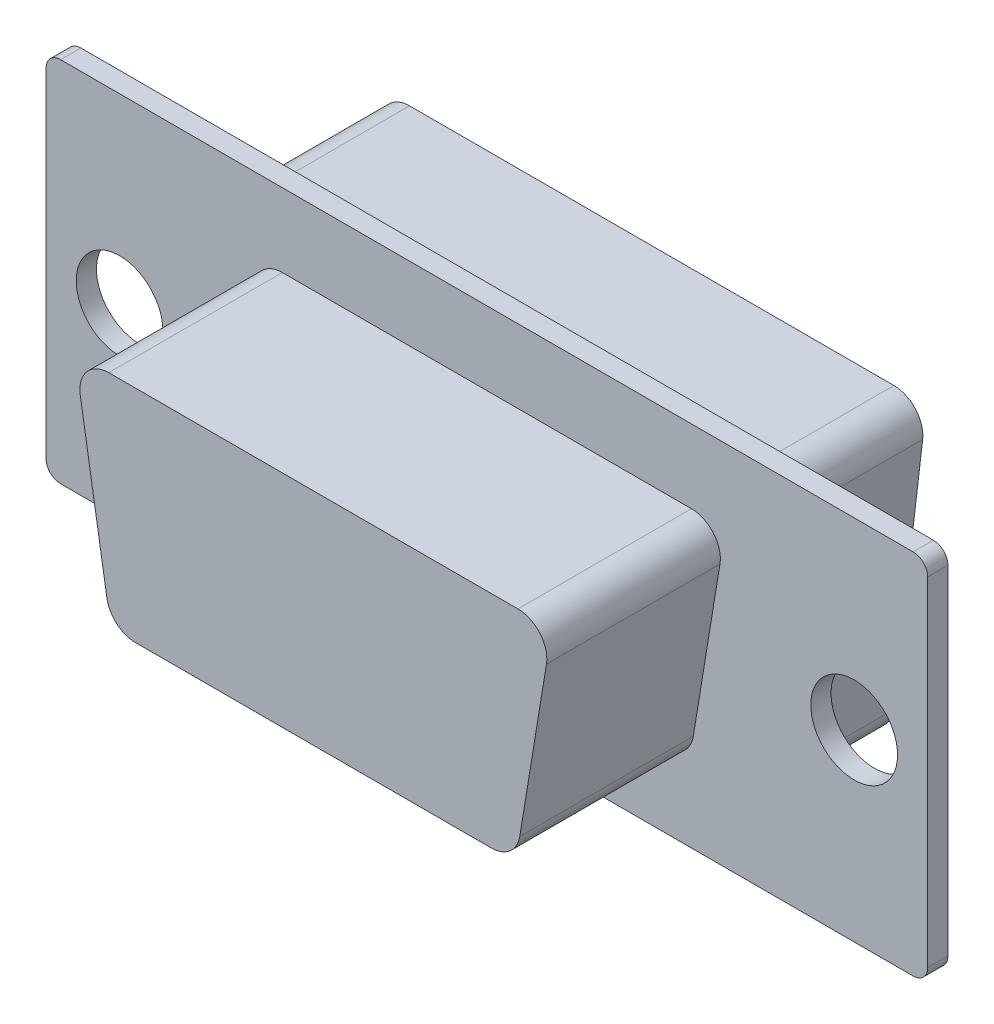
ISO-10303-21;
HEADER;
FILE_DESCRIPTION(('STEP AP214'),'2;1');
FILE_NAME('part.step','',(''),(''),'','','');
FILE_SCHEMA(('AUTOMOTIVE_DESIGN { 1 0 10303 214 1 1 1 1 }'));
ENDSEC;
DATA;
#1=APPLICATION_CONTEXT('core data for automotive mechanical design processes');
#2=APPLICATION_PROTOCOL_DEFINITION('international standard','automotive_design',2000,#1);
#3=PRODUCT_CONTEXT('',#1,'mechanical');
#4=PRODUCT('Part','Part','',(#3));
#5=PRODUCT_RELATED_PRODUCT_CATEGORY('part','',(#4));
#6=PRODUCT_DEFINITION_FORMATION('','',#4);
#7=PRODUCT_DEFINITION_CONTEXT('part definition',#1,'design');
#8=PRODUCT_DEFINITION('design','',#6,#7);
#9=PRODUCT_DEFINITION_SHAPE('','',#8);
#10=(LENGTH_UNIT() NAMED_UNIT(*) SI_UNIT(.MILLI.,.METRE.));
#11=(NAMED_UNIT(*) PLANE_ANGLE_UNIT() SI_UNIT($,.RADIAN.));
#12=(NAMED_UNIT(*) SI_UNIT($,.STERADIAN.) SOLID_ANGLE_UNIT());
#13=UNCERTAINTY_MEASURE_WITH_UNIT(LENGTH_MEASURE(1.E-05),#10,'distance_accuracy_value','');
#14=(GEOMETRIC_REPRESENTATION_CONTEXT(3) GLOBAL_UNCERTAINTY_ASSIGNED_CONTEXT((#13)) GLOBAL_UNIT_ASSIGNED_CONTEXT((#10,
#11,#12)) REPRESENTATION_CONTEXT('',''));
#15=CARTESIAN_POINT('',(0.,0.,0.));
#16=DIRECTION('',(0.,0.,1.));
#17=DIRECTION('',(1.,0.,0.));
#18=AXIS2_PLACEMENT_3D('',#15,#16,#17);
#19=CARTESIAN_POINT('',(0.,0.,0.));
#20=DIRECTION('',(0.,0.,1.));
#21=DIRECTION('',(1.,0.,0.));
#22=AXIS2_PLACEMENT_3D('',#19,#20,#21);
#23=PLANE('',#22);
#24=DIRECTION('',(1.,0.,0.));
#25=VECTOR('',#24,1.);
#26=CARTESIAN_POINT('',(-15.24,-6.35,0.));
#27=LINE('',#26,#25);
#28=CARTESIAN_POINT('',(-14.74,-6.35,0.));
#29=VERTEX_POINT('',#28);
#30=CARTESIAN_POINT('',(14.74,-6.35,0.));
#31=VERTEX_POINT('',#30);
#32=EDGE_CURVE('E210',#29,#31,#27,.T.);
#33=ORIENTED_EDGE('',*,*,#32,.F.);
#34=CARTESIAN_POINT('',(-14.74,-5.85,0.));
#35=DIRECTION('',(0.,0.,1.));
#36=DIRECTION('',(1.,0.,0.));
#37=AXIS2_PLACEMENT_3D('',#34,#35,#36);
#38=CIRCLE('',#37,0.5);
#39=CARTESIAN_POINT('',(-15.24,-5.85,0.));
#40=VERTEX_POINT('',#39);
#41=EDGE_CURVE('E193',#29,#40,#38,.F.);
#42=ORIENTED_EDGE('',*,*,#41,.T.);
#43=DIRECTION('',(0.,-1.,0.));
#44=VECTOR('',#43,1.);
#45=CARTESIAN_POINT('',(-15.24,6.35,0.));
#46=LINE('',#45,#44);
#47=CARTESIAN_POINT('',(-15.24,5.85,0.));
#48=VERTEX_POINT('',#47);
#49=EDGE_CURVE('E220',#48,#40,#46,.T.);
#50=ORIENTED_EDGE('',*,*,#49,.F.);
#51=CARTESIAN_POINT('',(-14.74,5.85,0.));
#52=DIRECTION('',(0.,0.,1.));
#53=DIRECTION('',(1.,0.,0.));
#54=AXIS2_PLACEMENT_3D('',#51,#52,#53);
#55=CIRCLE('',#54,0.5);
#56=CARTESIAN_POINT('',(-14.74,6.35,0.));
#57=VERTEX_POINT('',#56);
#58=EDGE_CURVE('E214',#48,#57,#55,.F.);
#59=ORIENTED_EDGE('',*,*,#58,.T.);
#60=DIRECTION('',(-1.,0.,0.));
#61=VECTOR('',#60,1.);
#62=CARTESIAN_POINT('',(-15.24,6.35,0.));
#63=LINE('',#62,#61);
#64=CARTESIAN_POINT('',(14.74,6.35,0.));
#65=VERTEX_POINT('',#64);
#66=EDGE_CURVE('E223',#65,#57,#63,.T.);
#67=ORIENTED_EDGE('',*,*,#66,.F.);
#68=CARTESIAN_POINT('',(14.74,5.85,0.));
#69=DIRECTION('',(0.,0.,1.));
#70=DIRECTION('',(1.,0.,0.));
#71=AXIS2_PLACEMENT_3D('',#68,#69,#70);
#72=CIRCLE('',#71,0.5);
#73=CARTESIAN_POINT('',(15.24,5.85,0.));
#74=VERTEX_POINT('',#73);
#75=EDGE_CURVE('E235',#65,#74,#72,.F.);
#76=ORIENTED_EDGE('',*,*,#75,.T.);
#77=DIRECTION('',(0.,1.,0.));
#78=VECTOR('',#77,1.);
#79=CARTESIAN_POINT('',(15.24,6.35,0.));
#80=LINE('',#79,#78);
#81=CARTESIAN_POINT('',(15.24,-5.85,0.));
#82=VERTEX_POINT('',#81);
#83=EDGE_CURVE('E219',#82,#74,#80,.T.);
#84=ORIENTED_EDGE('',*,*,#83,.F.);
#85=CARTESIAN_POINT('',(14.74,-5.85,0.));
#86=DIRECTION('',(0.,0.,1.));
#87=DIRECTION('',(1.,0.,0.));
#88=AXIS2_PLACEMENT_3D('',#85,#86,#87);
#89=CIRCLE('',#88,0.5);
#90=EDGE_CURVE('E204',#82,#31,#89,.F.);
#91=ORIENTED_EDGE('',*,*,#90,.T.);
#92=EDGE_LOOP('',(#33,#42,#50,#59,#67,#76,#84,#91));
#93=FACE_BOUND('',#92,.T.);
#94=CARTESIAN_POINT('',(-12.7,0.,0.));
#95=DIRECTION('',(0.,0.,1.));
#96=DIRECTION('',(1.,0.,0.));
#97=AXIS2_PLACEMENT_3D('',#94,#95,#96);
#98=CIRCLE('',#97,1.5);
#99=CARTESIAN_POINT('',(-11.2,0.,0.));
#100=VERTEX_POINT('',#99);
#101=EDGE_CURVE('E225',#100,#100,#98,.T.);
#102=ORIENTED_EDGE('',*,*,#101,.T.);
#103=EDGE_LOOP('',(#102));
#104=FACE_BOUND('',#103,.T.);
#105=CARTESIAN_POINT('',(12.7,0.,0.));
#106=DIRECTION('',(0.,0.,1.));
#107=DIRECTION('',(1.,0.,0.));
#108=AXIS2_PLACEMENT_3D('',#105,#106,#107);
#109=CIRCLE('',#108,1.5);
#110=CARTESIAN_POINT('',(14.2,0.,0.));
#111=VERTEX_POINT('',#110);
#112=EDGE_CURVE('E389',#111,#111,#109,.T.);
#113=ORIENTED_EDGE('',*,*,#112,.T.);
#114=EDGE_LOOP('',(#113));
#115=FACE_BOUND('',#114,.T.);
#116=DIRECTION('',(-0.117113041376648,-0.993118590873976,0.));
#117=VECTOR('',#116,1.);
#118=CARTESIAN_POINT('',(8.25,-5.3,0.));
#119=LINE('',#118,#117);
#120=CARTESIAN_POINT('',(9.36826497153577,4.18288695862336,0.));
#121=VERTEX_POINT('',#120);
#122=CARTESIAN_POINT('',(8.35411402813954,-4.41711304137665,0.));
#123=VERTEX_POINT('',#122);
#124=EDGE_CURVE('E362',#121,#123,#119,.T.);
#125=ORIENTED_EDGE('',*,*,#124,.F.);
#126=CARTESIAN_POINT('',(8.3751463806618,4.3,0.));
#127=DIRECTION('',(0.,0.,1.));
#128=DIRECTION('',(1.,0.,0.));
#129=AXIS2_PLACEMENT_3D('',#126,#127,#128);
#130=CIRCLE('',#129,1.);
#131=CARTESIAN_POINT('',(8.3751463806618,5.3,0.));
#132=VERTEX_POINT('',#131);
#133=EDGE_CURVE('E11',#121,#132,#130,.T.);
#134=ORIENTED_EDGE('',*,*,#133,.T.);
#135=DIRECTION('',(1.,0.,0.));
#136=VECTOR('',#135,1.);
#137=CARTESIAN_POINT('',(9.5,5.3,0.));
#138=LINE('',#137,#136);
#139=CARTESIAN_POINT('',(-8.3751463806618,5.3,0.));
#140=VERTEX_POINT('',#139);
#141=EDGE_CURVE('E330',#140,#132,#138,.T.);
#142=ORIENTED_EDGE('',*,*,#141,.F.);
#143=CARTESIAN_POINT('',(-8.3751463806618,4.3,0.));
#144=DIRECTION('',(0.,0.,1.));
#145=DIRECTION('',(1.,0.,0.));
#146=AXIS2_PLACEMENT_3D('',#143,#144,#145);
#147=CIRCLE('',#146,1.);
#148=CARTESIAN_POINT('',(-9.36826497153577,4.18288695862335,0.));
#149=VERTEX_POINT('',#148);
#150=EDGE_CURVE('E324',#140,#149,#147,.T.);
#151=ORIENTED_EDGE('',*,*,#150,.T.);
#152=DIRECTION('',(-0.117113041376648,0.993118590873976,0.));
#153=VECTOR('',#152,1.);
#154=CARTESIAN_POINT('',(-9.5,5.3,0.));
#155=LINE('',#154,#153);
#156=CARTESIAN_POINT('',(-8.35411402813954,-4.41711304137665,0.));
#157=VERTEX_POINT('',#156);
#158=EDGE_CURVE('E328',#157,#149,#155,.T.);
#159=ORIENTED_EDGE('',*,*,#158,.F.);
#160=CARTESIAN_POINT('',(-7.36099543726557,-4.3,0.));
#161=DIRECTION('',(0.,0.,1.));
#162=DIRECTION('',(1.,0.,0.));
#163=AXIS2_PLACEMENT_3D('',#160,#161,#162);
#164=CIRCLE('',#163,1.);
#165=CARTESIAN_POINT('',(-7.36099543726557,-5.3,0.));
#166=VERTEX_POINT('',#165);
#167=EDGE_CURVE('E322',#157,#166,#164,.T.);
#168=ORIENTED_EDGE('',*,*,#167,.T.);
#169=DIRECTION('',(-1.,0.,0.));
#170=VECTOR('',#169,1.);
#171=CARTESIAN_POINT('',(-8.25,-5.3,0.));
#172=LINE('',#171,#170);
#173=CARTESIAN_POINT('',(7.36099543726557,-5.3,0.));
#174=VERTEX_POINT('',#173);
#175=EDGE_CURVE('E339',#174,#166,#172,.T.);
#176=ORIENTED_EDGE('',*,*,#175,.F.);
#177=CARTESIAN_POINT('',(7.36099543726557,-4.3,0.));
#178=DIRECTION('',(0.,0.,1.));
#179=DIRECTION('',(1.,0.,0.));
#180=AXIS2_PLACEMENT_3D('',#177,#178,#179);
#181=CIRCLE('',#180,1.);
#182=EDGE_CURVE('E41',#174,#123,#181,.T.);
#183=ORIENTED_EDGE('',*,*,#182,.T.);
#184=EDGE_LOOP('',(#125,#134,#142,#151,#159,#168,#176,#183));
#185=FACE_BOUND('',#184,.T.);
#186=ADVANCED_FACE('F33',(#93,#104,#115,#185),#23,.F.);
#187=CARTESIAN_POINT('',(0.,0.,0.7));
#188=DIRECTION('',(0.,0.,1.));
#189=DIRECTION('',(1.,0.,0.));
#190=AXIS2_PLACEMENT_3D('',#187,#188,#189);
#191=PLANE('',#190);
#192=CARTESIAN_POINT('',(12.7,0.,0.7));
#193=DIRECTION('',(0.,0.,1.));
#194=DIRECTION('',(1.,0.,0.));
#195=AXIS2_PLACEMENT_3D('',#192,#193,#194);
#196=CIRCLE('',#195,1.5);
#197=CARTESIAN_POINT('',(14.2,0.,0.7));
#198=VERTEX_POINT('',#197);
#199=EDGE_CURVE('E380',#198,#198,#196,.T.);
#200=ORIENTED_EDGE('',*,*,#199,.F.);
#201=EDGE_LOOP('',(#200));
#202=FACE_BOUND('',#201,.T.);
#203=CARTESIAN_POINT('',(-12.7,0.,0.7));
#204=DIRECTION('',(0.,0.,1.));
#205=DIRECTION('',(1.,0.,0.));
#206=AXIS2_PLACEMENT_3D('',#203,#204,#205);
#207=CIRCLE('',#206,1.5);
#208=CARTESIAN_POINT('',(-11.2,0.,0.7));
#209=VERTEX_POINT('',#208);
#210=EDGE_CURVE('E392',#209,#209,#207,.T.);
#211=ORIENTED_EDGE('',*,*,#210,.F.);
#212=EDGE_LOOP('',(#211));
#213=FACE_BOUND('',#212,.T.);
#214=DIRECTION('',(0.,-1.,0.));
#215=VECTOR('',#214,1.);
#216=CARTESIAN_POINT('',(-15.24,6.35,0.7));
#217=LINE('',#216,#215);
#218=CARTESIAN_POINT('',(-15.24,5.85,0.7));
#219=VERTEX_POINT('',#218);
#220=CARTESIAN_POINT('',(-15.24,-5.85,0.7));
#221=VERTEX_POINT('',#220);
#222=EDGE_CURVE('E231',#219,#221,#217,.T.);
#223=ORIENTED_EDGE('',*,*,#222,.T.);
#224=CARTESIAN_POINT('',(-14.74,-5.85,0.7));
#225=DIRECTION('',(0.,0.,1.));
#226=DIRECTION('',(1.,0.,0.));
#227=AXIS2_PLACEMENT_3D('',#224,#225,#226);
#228=CIRCLE('',#227,0.5);
#229=CARTESIAN_POINT('',(-14.74,-6.35,0.7));
#230=VERTEX_POINT('',#229);
#231=EDGE_CURVE('E247',#221,#230,#228,.T.);
#232=ORIENTED_EDGE('',*,*,#231,.T.);
#233=DIRECTION('',(1.,0.,0.));
#234=VECTOR('',#233,1.);
#235=CARTESIAN_POINT('',(-15.24,-6.35,0.7));
#236=LINE('',#235,#234);
#237=CARTESIAN_POINT('',(14.74,-6.35,0.7));
#238=VERTEX_POINT('',#237);
#239=EDGE_CURVE('E213',#230,#238,#236,.T.);
#240=ORIENTED_EDGE('',*,*,#239,.T.);
#241=CARTESIAN_POINT('',(14.74,-5.85,0.7));
#242=DIRECTION('',(0.,0.,1.));
#243=DIRECTION('',(1.,0.,0.));
#244=AXIS2_PLACEMENT_3D('',#241,#242,#243);
#245=CIRCLE('',#244,0.5);
#246=CARTESIAN_POINT('',(15.24,-5.85,0.7));
#247=VERTEX_POINT('',#246);
#248=EDGE_CURVE('E245',#238,#247,#245,.T.);
#249=ORIENTED_EDGE('',*,*,#248,.T.);
#250=DIRECTION('',(0.,1.,0.));
#251=VECTOR('',#250,1.);
#252=CARTESIAN_POINT('',(15.24,6.35,0.7));
#253=LINE('',#252,#251);
#254=CARTESIAN_POINT('',(15.24,5.85,0.7));
#255=VERTEX_POINT('',#254);
#256=EDGE_CURVE('E402',#247,#255,#253,.T.);
#257=ORIENTED_EDGE('',*,*,#256,.T.);
#258=CARTESIAN_POINT('',(14.74,5.85,0.7));
#259=DIRECTION('',(0.,0.,1.));
#260=DIRECTION('',(1.,0.,0.));
#261=AXIS2_PLACEMENT_3D('',#258,#259,#260);
#262=CIRCLE('',#261,0.5);
#263=CARTESIAN_POINT('',(14.74,6.35,0.7));
#264=VERTEX_POINT('',#263);
#265=EDGE_CURVE('E243',#255,#264,#262,.T.);
#266=ORIENTED_EDGE('',*,*,#265,.T.);
#267=DIRECTION('',(-1.,0.,0.));
#268=VECTOR('',#267,1.);
#269=CARTESIAN_POINT('',(-15.24,6.35,0.7));
#270=LINE('',#269,#268);
#271=CARTESIAN_POINT('',(-14.74,6.35,0.7));
#272=VERTEX_POINT('',#271);
#273=EDGE_CURVE('E232',#264,#272,#270,.T.);
#274=ORIENTED_EDGE('',*,*,#273,.T.);
#275=CARTESIAN_POINT('',(-14.74,5.85,0.7));
#276=DIRECTION('',(0.,0.,1.));
#277=DIRECTION('',(1.,0.,0.));
#278=AXIS2_PLACEMENT_3D('',#275,#276,#277);
#279=CIRCLE('',#278,0.5);
#280=EDGE_CURVE('E241',#272,#219,#279,.T.);
#281=ORIENTED_EDGE('',*,*,#280,.T.);
#282=EDGE_LOOP('',(#223,#232,#240,#249,#257,#266,#274,#281));
#283=FACE_BOUND('',#282,.T.);
#284=DIRECTION('',(1.,0.,0.));
#285=VECTOR('',#284,1.);
#286=CARTESIAN_POINT('',(7.,-3.81,0.7));
#287=LINE('',#286,#285);
#288=CARTESIAN_POINT('',(-6.15067642594453,-3.81,0.7));
#289=VERTEX_POINT('',#288);
#290=CARTESIAN_POINT('',(6.15067642594452,-3.81,0.7));
#291=VERTEX_POINT('',#290);
#292=EDGE_CURVE('E356',#289,#291,#287,.T.);
#293=ORIENTED_EDGE('',*,*,#292,.F.);
#294=CARTESIAN_POINT('',(-6.15067642594453,-2.81,0.7));
#295=DIRECTION('',(0.,0.,1.));
#296=DIRECTION('',(1.,0.,0.));
#297=AXIS2_PLACEMENT_3D('',#294,#295,#296);
#298=CIRCLE('',#297,1.);
#299=CARTESIAN_POINT('',(-7.13748713945448,-2.97187839788549,0.7));
#300=VERTEX_POINT('',#299);
#301=EDGE_CURVE('E291',#289,#300,#298,.F.);
#302=ORIENTED_EDGE('',*,*,#301,.T.);
#303=DIRECTION('',(0.161878397885491,-0.986810713509955,0.));
#304=VECTOR('',#303,1.);
#305=CARTESIAN_POINT('',(-7.,-3.81,0.7));
#306=LINE('',#305,#304);
#307=CARTESIAN_POINT('',(-8.05940314995317,2.64812160211451,0.7));
#308=VERTEX_POINT('',#307);
#309=EDGE_CURVE('E353',#308,#300,#306,.T.);
#310=ORIENTED_EDGE('',*,*,#309,.F.);
#311=CARTESIAN_POINT('',(-7.07259243644321,2.81,0.7));
#312=DIRECTION('',(0.,0.,1.));
#313=DIRECTION('',(1.,0.,0.));
#314=AXIS2_PLACEMENT_3D('',#311,#312,#313);
#315=CIRCLE('',#314,1.);
#316=CARTESIAN_POINT('',(-7.07259243644321,3.81,0.7));
#317=VERTEX_POINT('',#316);
#318=EDGE_CURVE('E293',#308,#317,#315,.F.);
#319=ORIENTED_EDGE('',*,*,#318,.T.);
#320=DIRECTION('',(-1.,0.,0.));
#321=VECTOR('',#320,1.);
#322=CARTESIAN_POINT('',(-8.25,3.81,0.7));
#323=LINE('',#322,#321);
#324=CARTESIAN_POINT('',(7.07259243644321,3.81,0.7));
#325=VERTEX_POINT('',#324);
#326=EDGE_CURVE('E372',#325,#317,#323,.T.);
#327=ORIENTED_EDGE('',*,*,#326,.F.);
#328=CARTESIAN_POINT('',(7.07259243644321,2.81,0.7));
#329=DIRECTION('',(0.,0.,1.));
#330=DIRECTION('',(1.,0.,0.));
#331=AXIS2_PLACEMENT_3D('',#328,#329,#330);
#332=CIRCLE('',#331,1.);
#333=CARTESIAN_POINT('',(8.05940314995317,2.64812160211451,0.7));
#334=VERTEX_POINT('',#333);
#335=EDGE_CURVE('E289',#325,#334,#332,.F.);
#336=ORIENTED_EDGE('',*,*,#335,.T.);
#337=DIRECTION('',(0.161878397885491,0.986810713509955,0.));
#338=VECTOR('',#337,1.);
#339=CARTESIAN_POINT('',(8.25,3.81,0.7));
#340=LINE('',#339,#338);
#341=CARTESIAN_POINT('',(7.13748713945448,-2.97187839788549,0.7));
#342=VERTEX_POINT('',#341);
#343=EDGE_CURVE('E384',#342,#334,#340,.T.);
#344=ORIENTED_EDGE('',*,*,#343,.F.);
#345=CARTESIAN_POINT('',(6.15067642594452,-2.81,0.7));
#346=DIRECTION('',(0.,0.,1.));
#347=DIRECTION('',(1.,0.,0.));
#348=AXIS2_PLACEMENT_3D('',#345,#346,#347);
#349=CIRCLE('',#348,1.);
#350=EDGE_CURVE('E287',#342,#291,#349,.F.);
#351=ORIENTED_EDGE('',*,*,#350,.T.);
#352=EDGE_LOOP('',(#293,#302,#310,#319,#327,#336,#344,#351));
#353=FACE_BOUND('',#352,.T.);
#354=ADVANCED_FACE('F408',(#202,#213,#283,#353),#191,.T.);
#355=CARTESIAN_POINT('',(-15.24,6.35,0.7));
#356=DIRECTION('',(1.,0.,0.));
#357=DIRECTION('',(0.,0.,-1.));
#358=AXIS2_PLACEMENT_3D('',#355,#356,#357);
#359=PLANE('',#358);
#360=ORIENTED_EDGE('',*,*,#49,.T.);
#361=DIRECTION('',(0.,0.,-1.));
#362=VECTOR('',#361,1.);
#363=CARTESIAN_POINT('',(-15.24,-5.85,0.7));
#364=LINE('',#363,#362);
#365=EDGE_CURVE('E198',#40,#221,#364,.F.);
#366=ORIENTED_EDGE('',*,*,#365,.T.);
#367=ORIENTED_EDGE('',*,*,#222,.F.);
#368=DIRECTION('',(0.,0.,-1.));
#369=VECTOR('',#368,1.);
#370=CARTESIAN_POINT('',(-15.24,5.85,0.7));
#371=LINE('',#370,#369);
#372=EDGE_CURVE('E203',#219,#48,#371,.T.);
#373=ORIENTED_EDGE('',*,*,#372,.T.);
#374=EDGE_LOOP('',(#360,#366,#367,#373));
#375=FACE_BOUND('',#374,.T.);
#376=ADVANCED_FACE('F419',(#375),#359,.F.);
#377=CARTESIAN_POINT('',(-15.24,-6.35,0.7));
#378=DIRECTION('',(0.,1.,0.));
#379=DIRECTION('',(-1.,0.,0.));
#380=AXIS2_PLACEMENT_3D('',#377,#378,#379);
#381=PLANE('',#380);
#382=ORIENTED_EDGE('',*,*,#239,.F.);
#383=DIRECTION('',(0.,0.,-1.));
#384=VECTOR('',#383,1.);
#385=CARTESIAN_POINT('',(-14.74,-6.35,0.7));
#386=LINE('',#385,#384);
#387=EDGE_CURVE('E197',#230,#29,#386,.T.);
#388=ORIENTED_EDGE('',*,*,#387,.T.);
#389=ORIENTED_EDGE('',*,*,#32,.T.);
#390=DIRECTION('',(0.,0.,-1.));
#391=VECTOR('',#390,1.);
#392=CARTESIAN_POINT('',(14.74,-6.35,0.7));
#393=LINE('',#392,#391);
#394=EDGE_CURVE('E215',#31,#238,#393,.F.);
#395=ORIENTED_EDGE('',*,*,#394,.T.);
#396=EDGE_LOOP('',(#382,#388,#389,#395));
#397=FACE_BOUND('',#396,.T.);
#398=ADVANCED_FACE('F209',(#397),#381,.F.);
#399=CARTESIAN_POINT('',(15.24,6.35,0.7));
#400=DIRECTION('',(-1.,0.,0.));
#401=DIRECTION('',(0.,0.,1.));
#402=AXIS2_PLACEMENT_3D('',#399,#400,#401);
#403=PLANE('',#402);
#404=ORIENTED_EDGE('',*,*,#256,.F.);
#405=DIRECTION('',(0.,0.,-1.));
#406=VECTOR('',#405,1.);
#407=CARTESIAN_POINT('',(15.24,-5.85,0.7));
#408=LINE('',#407,#406);
#409=EDGE_CURVE('E251',#247,#82,#408,.T.);
#410=ORIENTED_EDGE('',*,*,#409,.T.);
#411=ORIENTED_EDGE('',*,*,#83,.T.);
#412=DIRECTION('',(0.,0.,-1.));
#413=VECTOR('',#412,1.);
#414=CARTESIAN_POINT('',(15.24,5.85,0.7));
#415=LINE('',#414,#413);
#416=EDGE_CURVE('E249',#74,#255,#415,.F.);
#417=ORIENTED_EDGE('',*,*,#416,.T.);
#418=EDGE_LOOP('',(#404,#410,#411,#417));
#419=FACE_BOUND('',#418,.T.);
#420=ADVANCED_FACE('F427',(#419),#403,.F.);
#421=CARTESIAN_POINT('',(-15.24,6.35,0.7));
#422=DIRECTION('',(0.,-1.,0.));
#423=DIRECTION('',(0.,0.,-1.));
#424=AXIS2_PLACEMENT_3D('',#421,#422,#423);
#425=PLANE('',#424);
#426=ORIENTED_EDGE('',*,*,#273,.F.);
#427=DIRECTION('',(0.,0.,-1.));
#428=VECTOR('',#427,1.);
#429=CARTESIAN_POINT('',(14.74,6.35,0.7));
#430=LINE('',#429,#428);
#431=EDGE_CURVE('E256',#264,#65,#430,.T.);
#432=ORIENTED_EDGE('',*,*,#431,.T.);
#433=ORIENTED_EDGE('',*,*,#66,.T.);
#434=DIRECTION('',(0.,0.,-1.));
#435=VECTOR('',#434,1.);
#436=CARTESIAN_POINT('',(-14.74,6.35,0.7));
#437=LINE('',#436,#435);
#438=EDGE_CURVE('E254',#57,#272,#437,.F.);
#439=ORIENTED_EDGE('',*,*,#438,.T.);
#440=EDGE_LOOP('',(#426,#432,#433,#439));
#441=FACE_BOUND('',#440,.T.);
#442=ADVANCED_FACE('F421',(#441),#425,.F.);
#443=CARTESIAN_POINT('',(-14.74,-5.85,0.7));
#444=DIRECTION('',(0.,0.,-1.));
#445=DIRECTION('',(-1.,0.,0.));
#446=AXIS2_PLACEMENT_3D('',#443,#444,#445);
#447=CYLINDRICAL_SURFACE('',#446,0.5);
#448=ORIENTED_EDGE('',*,*,#231,.F.);
#449=ORIENTED_EDGE('',*,*,#365,.F.);
#450=ORIENTED_EDGE('',*,*,#41,.F.);
#451=ORIENTED_EDGE('',*,*,#387,.F.);
#452=EDGE_LOOP('',(#448,#449,#450,#451));
#453=FACE_BOUND('',#452,.T.);
#454=ADVANCED_FACE('F196',(#453),#447,.T.);
#455=CARTESIAN_POINT('',(14.74,-5.85,0.7));
#456=DIRECTION('',(0.,0.,-1.));
#457=DIRECTION('',(-1.,0.,0.));
#458=AXIS2_PLACEMENT_3D('',#455,#456,#457);
#459=CYLINDRICAL_SURFACE('',#458,0.5);
#460=ORIENTED_EDGE('',*,*,#248,.F.);
#461=ORIENTED_EDGE('',*,*,#394,.F.);
#462=ORIENTED_EDGE('',*,*,#90,.F.);
#463=ORIENTED_EDGE('',*,*,#409,.F.);
#464=EDGE_LOOP('',(#460,#461,#462,#463));
#465=FACE_BOUND('',#464,.T.);
#466=ADVANCED_FACE('F431',(#465),#459,.T.);
#467=CARTESIAN_POINT('',(14.74,5.85,0.7));
#468=DIRECTION('',(0.,0.,-1.));
#469=DIRECTION('',(-1.,0.,0.));
#470=AXIS2_PLACEMENT_3D('',#467,#468,#469);
#471=CYLINDRICAL_SURFACE('',#470,0.5);
#472=ORIENTED_EDGE('',*,*,#265,.F.);
#473=ORIENTED_EDGE('',*,*,#416,.F.);
#474=ORIENTED_EDGE('',*,*,#75,.F.);
#475=ORIENTED_EDGE('',*,*,#431,.F.);
#476=EDGE_LOOP('',(#472,#473,#474,#475));
#477=FACE_BOUND('',#476,.T.);
#478=ADVANCED_FACE('F423',(#477),#471,.T.);
#479=CARTESIAN_POINT('',(-14.74,5.85,0.7));
#480=DIRECTION('',(0.,0.,-1.));
#481=DIRECTION('',(-1.,0.,0.));
#482=AXIS2_PLACEMENT_3D('',#479,#480,#481);
#483=CYLINDRICAL_SURFACE('',#482,0.5);
#484=ORIENTED_EDGE('',*,*,#280,.F.);
#485=ORIENTED_EDGE('',*,*,#438,.F.);
#486=ORIENTED_EDGE('',*,*,#58,.F.);
#487=ORIENTED_EDGE('',*,*,#372,.F.);
#488=EDGE_LOOP('',(#484,#485,#486,#487));
#489=FACE_BOUND('',#488,.T.);
#490=ADVANCED_FACE('F417',(#489),#483,.T.);
#491=CARTESIAN_POINT('',(-12.7,0.,0.));
#492=DIRECTION('',(0.,0.,1.));
#493=DIRECTION('',(1.,0.,0.));
#494=AXIS2_PLACEMENT_3D('',#491,#492,#493);
#495=CYLINDRICAL_SURFACE('',#494,1.5);
#496=ORIENTED_EDGE('',*,*,#101,.F.);
#497=EDGE_LOOP('',(#496));
#498=FACE_BOUND('',#497,.T.);
#499=ORIENTED_EDGE('',*,*,#210,.T.);
#500=EDGE_LOOP('',(#499));
#501=FACE_BOUND('',#500,.T.);
#502=ADVANCED_FACE('F495',(#498,#501),#495,.F.);
#503=CARTESIAN_POINT('',(12.7,0.,0.));
#504=DIRECTION('',(0.,0.,1.));
#505=DIRECTION('',(1.,0.,0.));
#506=AXIS2_PLACEMENT_3D('',#503,#504,#505);
#507=CYLINDRICAL_SURFACE('',#506,1.5);
#508=ORIENTED_EDGE('',*,*,#112,.F.);
#509=EDGE_LOOP('',(#508));
#510=FACE_BOUND('',#509,.T.);
#511=ORIENTED_EDGE('',*,*,#199,.T.);
#512=EDGE_LOOP('',(#511));
#513=FACE_BOUND('',#512,.T.);
#514=ADVANCED_FACE('F504',(#510,#513),#507,.F.);
#515=CARTESIAN_POINT('',(-7.,-3.81,6.7));
#516=DIRECTION('',(0.986810713509955,0.161878397885491,0.));
#517=DIRECTION('',(-0.161878397885491,0.986810713509955,0.));
#518=AXIS2_PLACEMENT_3D('',#515,#516,#517);
#519=PLANE('',#518);
#520=ORIENTED_EDGE('',*,*,#309,.T.);
#521=DIRECTION('',(0.,0.,-1.));
#522=VECTOR('',#521,1.);
#523=CARTESIAN_POINT('',(-7.13748713945448,-2.97187839788549,6.7));
#524=LINE('',#523,#522);
#525=CARTESIAN_POINT('',(-7.13748713945448,-2.97187839788549,6.7));
#526=VERTEX_POINT('',#525);
#527=EDGE_CURVE('E285',#300,#526,#524,.F.);
#528=ORIENTED_EDGE('',*,*,#527,.T.);
#529=DIRECTION('',(0.161878397885491,-0.986810713509955,0.));
#530=VECTOR('',#529,1.);
#531=CARTESIAN_POINT('',(-7.,-3.81,6.7));
#532=LINE('',#531,#530);
#533=CARTESIAN_POINT('',(-8.05940314995317,2.64812160211451,6.7));
#534=VERTEX_POINT('',#533);
#535=EDGE_CURVE('E368',#534,#526,#532,.T.);
#536=ORIENTED_EDGE('',*,*,#535,.F.);
#537=DIRECTION('',(0.,0.,-1.));
#538=VECTOR('',#537,1.);
#539=CARTESIAN_POINT('',(-8.05940314995317,2.64812160211451,6.7));
#540=LINE('',#539,#538);
#541=EDGE_CURVE('E282',#534,#308,#540,.T.);
#542=ORIENTED_EDGE('',*,*,#541,.T.);
#543=EDGE_LOOP('',(#520,#528,#536,#542));
#544=FACE_BOUND('',#543,.T.);
#545=ADVANCED_FACE('F512',(#544),#519,.F.);
#546=CARTESIAN_POINT('',(7.,-3.81,6.7));
#547=DIRECTION('',(0.,1.,0.));
#548=DIRECTION('',(0.,0.,1.));
#549=AXIS2_PLACEMENT_3D('',#546,#547,#548);
#550=PLANE('',#549);
#551=ORIENTED_EDGE('',*,*,#292,.T.);
#552=DIRECTION('',(0.,0.,-1.));
#553=VECTOR('',#552,1.);
#554=CARTESIAN_POINT('',(6.15067642594452,-3.81,6.7));
#555=LINE('',#554,#553);
#556=CARTESIAN_POINT('',(6.15067642594452,-3.81,6.7));
#557=VERTEX_POINT('',#556);
#558=EDGE_CURVE('E267',#291,#557,#555,.F.);
#559=ORIENTED_EDGE('',*,*,#558,.T.);
#560=DIRECTION('',(1.,0.,0.));
#561=VECTOR('',#560,1.);
#562=CARTESIAN_POINT('',(7.,-3.81,6.7));
#563=LINE('',#562,#561);
#564=CARTESIAN_POINT('',(-6.15067642594453,-3.81,6.7));
#565=VERTEX_POINT('',#564);
#566=EDGE_CURVE('E371',#565,#557,#563,.T.);
#567=ORIENTED_EDGE('',*,*,#566,.F.);
#568=DIRECTION('',(0.,0.,-1.));
#569=VECTOR('',#568,1.);
#570=CARTESIAN_POINT('',(-6.15067642594453,-3.81,6.7));
#571=LINE('',#570,#569);
#572=EDGE_CURVE('E264',#565,#289,#571,.T.);
#573=ORIENTED_EDGE('',*,*,#572,.T.);
#574=EDGE_LOOP('',(#551,#559,#567,#573));
#575=FACE_BOUND('',#574,.T.);
#576=ADVANCED_FACE('F528',(#575),#550,.F.);
#577=CARTESIAN_POINT('',(8.25,3.81,6.7));
#578=DIRECTION('',(-0.986810713509955,0.161878397885491,0.));
#579=DIRECTION('',(-0.161878397885491,-0.986810713509955,0.));
#580=AXIS2_PLACEMENT_3D('',#577,#578,#579);
#581=PLANE('',#580);
#582=DIRECTION('',(0.161878397885491,0.986810713509955,0.));
#583=VECTOR('',#582,1.);
#584=CARTESIAN_POINT('',(8.25,3.81,6.7));
#585=LINE('',#584,#583);
#586=CARTESIAN_POINT('',(7.13748713945448,-2.97187839788549,6.7));
#587=VERTEX_POINT('',#586);
#588=CARTESIAN_POINT('',(8.05940314995317,2.64812160211451,6.7));
#589=VERTEX_POINT('',#588);
#590=EDGE_CURVE('E375',#587,#589,#585,.T.);
#591=ORIENTED_EDGE('',*,*,#590,.F.);
#592=DIRECTION('',(0.,0.,-1.));
#593=VECTOR('',#592,1.);
#594=CARTESIAN_POINT('',(7.13748713945448,-2.97187839788549,6.7));
#595=LINE('',#594,#593);
#596=EDGE_CURVE('E261',#587,#342,#595,.T.);
#597=ORIENTED_EDGE('',*,*,#596,.T.);
#598=ORIENTED_EDGE('',*,*,#343,.T.);
#599=DIRECTION('',(0.,0.,-1.));
#600=VECTOR('',#599,1.);
#601=CARTESIAN_POINT('',(8.05940314995317,2.64812160211451,6.7));
#602=LINE('',#601,#600);
#603=EDGE_CURVE('E259',#334,#589,#602,.F.);
#604=ORIENTED_EDGE('',*,*,#603,.T.);
#605=EDGE_LOOP('',(#591,#597,#598,#604));
#606=FACE_BOUND('',#605,.T.);
#607=ADVANCED_FACE('F538',(#606),#581,.F.);
#608=CARTESIAN_POINT('',(-8.25,3.81,6.7));
#609=DIRECTION('',(0.,-1.,0.));
#610=DIRECTION('',(0.,0.,-1.));
#611=AXIS2_PLACEMENT_3D('',#608,#609,#610);
#612=PLANE('',#611);
#613=DIRECTION('',(-1.,0.,0.));
#614=VECTOR('',#613,1.);
#615=CARTESIAN_POINT('',(-8.25,3.81,6.7));
#616=LINE('',#615,#614);
#617=CARTESIAN_POINT('',(7.07259243644321,3.81,6.7));
#618=VERTEX_POINT('',#617);
#619=CARTESIAN_POINT('',(-7.07259243644321,3.81,6.7));
#620=VERTEX_POINT('',#619);
#621=EDGE_CURVE('E378',#618,#620,#616,.T.);
#622=ORIENTED_EDGE('',*,*,#621,.F.);
#623=DIRECTION('',(0.,0.,-1.));
#624=VECTOR('',#623,1.);
#625=CARTESIAN_POINT('',(7.07259243644321,3.81,6.7));
#626=LINE('',#625,#624);
#627=EDGE_CURVE('E279',#618,#325,#626,.T.);
#628=ORIENTED_EDGE('',*,*,#627,.T.);
#629=ORIENTED_EDGE('',*,*,#326,.T.);
#630=DIRECTION('',(0.,0.,-1.));
#631=VECTOR('',#630,1.);
#632=CARTESIAN_POINT('',(-7.07259243644321,3.81,6.7));
#633=LINE('',#632,#631);
#634=EDGE_CURVE('E277',#317,#620,#633,.F.);
#635=ORIENTED_EDGE('',*,*,#634,.T.);
#636=EDGE_LOOP('',(#622,#628,#629,#635));
#637=FACE_BOUND('',#636,.T.);
#638=ADVANCED_FACE('F548',(#637),#612,.F.);
#639=CARTESIAN_POINT('',(0.,0.,6.7));
#640=DIRECTION('',(0.,0.,-1.));
#641=DIRECTION('',(-1.,0.,0.));
#642=AXIS2_PLACEMENT_3D('',#639,#640,#641);
#643=PLANE('',#642);
#644=ORIENTED_EDGE('',*,*,#566,.T.);
#645=CARTESIAN_POINT('',(6.15067642594452,-2.81,6.7));
#646=DIRECTION('',(0.,0.,-1.));
#647=DIRECTION('',(-1.,0.,0.));
#648=AXIS2_PLACEMENT_3D('',#645,#646,#647);
#649=CIRCLE('',#648,1.);
#650=EDGE_CURVE('E275',#557,#587,#649,.F.);
#651=ORIENTED_EDGE('',*,*,#650,.T.);
#652=ORIENTED_EDGE('',*,*,#590,.T.);
#653=CARTESIAN_POINT('',(7.07259243644321,2.81,6.7));
#654=DIRECTION('',(0.,0.,-1.));
#655=DIRECTION('',(-1.,0.,0.));
#656=AXIS2_PLACEMENT_3D('',#653,#654,#655);
#657=CIRCLE('',#656,1.);
#658=EDGE_CURVE('E273',#589,#618,#657,.F.);
#659=ORIENTED_EDGE('',*,*,#658,.T.);
#660=ORIENTED_EDGE('',*,*,#621,.T.);
#661=CARTESIAN_POINT('',(-7.07259243644321,2.81,6.7));
#662=DIRECTION('',(0.,0.,-1.));
#663=DIRECTION('',(-1.,0.,0.));
#664=AXIS2_PLACEMENT_3D('',#661,#662,#663);
#665=CIRCLE('',#664,1.);
#666=EDGE_CURVE('E269',#620,#534,#665,.F.);
#667=ORIENTED_EDGE('',*,*,#666,.T.);
#668=ORIENTED_EDGE('',*,*,#535,.T.);
#669=CARTESIAN_POINT('',(-6.15067642594453,-2.81,6.7));
#670=DIRECTION('',(0.,0.,-1.));
#671=DIRECTION('',(-1.,0.,0.));
#672=AXIS2_PLACEMENT_3D('',#669,#670,#671);
#673=CIRCLE('',#672,1.);
#674=EDGE_CURVE('E271',#526,#565,#673,.F.);
#675=ORIENTED_EDGE('',*,*,#674,.T.);
#676=EDGE_LOOP('',(#644,#651,#652,#659,#660,#667,#668,#675));
#677=FACE_BOUND('',#676,.T.);
#678=ADVANCED_FACE('F558',(#677),#643,.F.);
#679=CARTESIAN_POINT('',(6.15067642594452,-2.81,6.7));
#680=DIRECTION('',(0.,0.,-1.));
#681=DIRECTION('',(-1.,0.,0.));
#682=AXIS2_PLACEMENT_3D('',#679,#680,#681);
#683=CYLINDRICAL_SURFACE('',#682,1.);
#684=ORIENTED_EDGE('',*,*,#650,.F.);
#685=ORIENTED_EDGE('',*,*,#558,.F.);
#686=ORIENTED_EDGE('',*,*,#350,.F.);
#687=ORIENTED_EDGE('',*,*,#596,.F.);
#688=EDGE_LOOP('',(#684,#685,#686,#687));
#689=FACE_BOUND('',#688,.T.);
#690=ADVANCED_FACE('F568',(#689),#683,.T.);
#691=CARTESIAN_POINT('',(7.07259243644321,2.81,6.7));
#692=DIRECTION('',(0.,0.,-1.));
#693=DIRECTION('',(-1.,0.,0.));
#694=AXIS2_PLACEMENT_3D('',#691,#692,#693);
#695=CYLINDRICAL_SURFACE('',#694,1.);
#696=ORIENTED_EDGE('',*,*,#658,.F.);
#697=ORIENTED_EDGE('',*,*,#603,.F.);
#698=ORIENTED_EDGE('',*,*,#335,.F.);
#699=ORIENTED_EDGE('',*,*,#627,.F.);
#700=EDGE_LOOP('',(#696,#697,#698,#699));
#701=FACE_BOUND('',#700,.T.);
#702=ADVANCED_FACE('F578',(#701),#695,.T.);
#703=CARTESIAN_POINT('',(-6.15067642594453,-2.81,6.7));
#704=DIRECTION('',(0.,0.,-1.));
#705=DIRECTION('',(-1.,0.,0.));
#706=AXIS2_PLACEMENT_3D('',#703,#704,#705);
#707=CYLINDRICAL_SURFACE('',#706,1.);
#708=ORIENTED_EDGE('',*,*,#674,.F.);
#709=ORIENTED_EDGE('',*,*,#527,.F.);
#710=ORIENTED_EDGE('',*,*,#301,.F.);
#711=ORIENTED_EDGE('',*,*,#572,.F.);
#712=EDGE_LOOP('',(#708,#709,#710,#711));
#713=FACE_BOUND('',#712,.T.);
#714=ADVANCED_FACE('F588',(#713),#707,.T.);
#715=CARTESIAN_POINT('',(-7.07259243644321,2.81,6.7));
#716=DIRECTION('',(0.,0.,-1.));
#717=DIRECTION('',(-1.,0.,0.));
#718=AXIS2_PLACEMENT_3D('',#715,#716,#717);
#719=CYLINDRICAL_SURFACE('',#718,1.);
#720=ORIENTED_EDGE('',*,*,#666,.F.);
#721=ORIENTED_EDGE('',*,*,#634,.F.);
#722=ORIENTED_EDGE('',*,*,#318,.F.);
#723=ORIENTED_EDGE('',*,*,#541,.F.);
#724=EDGE_LOOP('',(#720,#721,#722,#723));
#725=FACE_BOUND('',#724,.T.);
#726=ADVANCED_FACE('F597',(#725),#719,.T.);
#727=CARTESIAN_POINT('',(8.25,-5.3,-5.));
#728=DIRECTION('',(-0.993118590873976,0.117113041376648,0.));
#729=DIRECTION('',(-0.117113041376648,-0.993118590873976,0.));
#730=AXIS2_PLACEMENT_3D('',#727,#728,#729);
#731=PLANE('',#730);
#732=ORIENTED_EDGE('',*,*,#124,.T.);
#733=DIRECTION('',(0.,0.,1.));
#734=VECTOR('',#733,1.);
#735=CARTESIAN_POINT('',(8.35411402813954,-4.41711304137665,-5.));
#736=LINE('',#735,#734);
#737=CARTESIAN_POINT('',(8.35411402813954,-4.41711304137665,-5.));
#738=VERTEX_POINT('',#737);
#739=EDGE_CURVE('E320',#123,#738,#736,.F.);
#740=ORIENTED_EDGE('',*,*,#739,.T.);
#741=DIRECTION('',(-0.117113041376648,-0.993118590873976,0.));
#742=VECTOR('',#741,1.);
#743=CARTESIAN_POINT('',(8.25,-5.3,-5.));
#744=LINE('',#743,#742);
#745=CARTESIAN_POINT('',(9.36826497153577,4.18288695862336,-5.));
#746=VERTEX_POINT('',#745);
#747=EDGE_CURVE('E367',#746,#738,#744,.T.);
#748=ORIENTED_EDGE('',*,*,#747,.F.);
#749=DIRECTION('',(0.,0.,1.));
#750=VECTOR('',#749,1.);
#751=CARTESIAN_POINT('',(9.36826497153577,4.18288695862335,-5.));
#752=LINE('',#751,#750);
#753=EDGE_CURVE('E318',#746,#121,#752,.T.);
#754=ORIENTED_EDGE('',*,*,#753,.T.);
#755=EDGE_LOOP('',(#732,#740,#748,#754));
#756=FACE_BOUND('',#755,.T.);
#757=ADVANCED_FACE('F606',(#756),#731,.F.);
#758=CARTESIAN_POINT('',(-8.25,-5.3,-5.));
#759=DIRECTION('',(0.,1.,0.));
#760=DIRECTION('',(0.,0.,1.));
#761=AXIS2_PLACEMENT_3D('',#758,#759,#760);
#762=PLANE('',#761);
#763=ORIENTED_EDGE('',*,*,#175,.T.);
#764=DIRECTION('',(0.,0.,1.));
#765=VECTOR('',#764,1.);
#766=CARTESIAN_POINT('',(-7.36099543726557,-5.3,-5.));
#767=LINE('',#766,#765);
#768=CARTESIAN_POINT('',(-7.36099543726557,-5.3,-5.));
#769=VERTEX_POINT('',#768);
#770=EDGE_CURVE('E303',#166,#769,#767,.F.);
#771=ORIENTED_EDGE('',*,*,#770,.T.);
#772=DIRECTION('',(-1.,0.,0.));
#773=VECTOR('',#772,1.);
#774=CARTESIAN_POINT('',(-8.25,-5.3,-5.));
#775=LINE('',#774,#773);
#776=CARTESIAN_POINT('',(7.36099543726557,-5.3,-5.));
#777=VERTEX_POINT('',#776);
#778=EDGE_CURVE('E358',#777,#769,#775,.T.);
#779=ORIENTED_EDGE('',*,*,#778,.F.);
#780=DIRECTION('',(0.,0.,1.));
#781=VECTOR('',#780,1.);
#782=CARTESIAN_POINT('',(7.36099543726557,-5.3,-5.));
#783=LINE('',#782,#781);
#784=EDGE_CURVE('E300',#777,#174,#783,.T.);
#785=ORIENTED_EDGE('',*,*,#784,.T.);
#786=EDGE_LOOP('',(#763,#771,#779,#785));
#787=FACE_BOUND('',#786,.T.);
#788=ADVANCED_FACE('F620',(#787),#762,.F.);
#789=CARTESIAN_POINT('',(-9.5,5.3,-5.));
#790=DIRECTION('',(0.993118590873976,0.117113041376648,0.));
#791=DIRECTION('',(-0.117113041376648,0.993118590873976,0.));
#792=AXIS2_PLACEMENT_3D('',#789,#790,#791);
#793=PLANE('',#792);
#794=DIRECTION('',(-0.117113041376648,0.993118590873976,0.));
#795=VECTOR('',#794,1.);
#796=CARTESIAN_POINT('',(-9.5,5.3,-5.));
#797=LINE('',#796,#795);
#798=CARTESIAN_POINT('',(-8.35411402813954,-4.41711304137665,-5.));
#799=VERTEX_POINT('',#798);
#800=CARTESIAN_POINT('',(-9.36826497153577,4.18288695862335,-5.));
#801=VERTEX_POINT('',#800);
#802=EDGE_CURVE('E350',#799,#801,#797,.T.);
#803=ORIENTED_EDGE('',*,*,#802,.F.);
#804=DIRECTION('',(0.,0.,1.));
#805=VECTOR('',#804,1.);
#806=CARTESIAN_POINT('',(-8.35411402813955,-4.41711304137665,-5.));
#807=LINE('',#806,#805);
#808=EDGE_CURVE('E297',#799,#157,#807,.T.);
#809=ORIENTED_EDGE('',*,*,#808,.T.);
#810=ORIENTED_EDGE('',*,*,#158,.T.);
#811=DIRECTION('',(0.,0.,1.));
#812=VECTOR('',#811,1.);
#813=CARTESIAN_POINT('',(-9.36826497153577,4.18288695862335,-5.));
#814=LINE('',#813,#812);
#815=EDGE_CURVE('E295',#149,#801,#814,.F.);
#816=ORIENTED_EDGE('',*,*,#815,.T.);
#817=EDGE_LOOP('',(#803,#809,#810,#816));
#818=FACE_BOUND('',#817,.T.);
#819=ADVANCED_FACE('F336',(#818),#793,.F.);
#820=CARTESIAN_POINT('',(9.5,5.3,-5.));
#821=DIRECTION('',(0.,-1.,0.));
#822=DIRECTION('',(0.,0.,-1.));
#823=AXIS2_PLACEMENT_3D('',#820,#821,#822);
#824=PLANE('',#823);
#825=DIRECTION('',(1.,0.,0.));
#826=VECTOR('',#825,1.);
#827=CARTESIAN_POINT('',(9.5,5.3,-5.));
#828=LINE('',#827,#826);
#829=CARTESIAN_POINT('',(-8.3751463806618,5.3,-5.));
#830=VERTEX_POINT('',#829);
#831=CARTESIAN_POINT('',(8.3751463806618,5.3,-5.));
#832=VERTEX_POINT('',#831);
#833=EDGE_CURVE('E348',#830,#832,#828,.T.);
#834=ORIENTED_EDGE('',*,*,#833,.F.);
#835=DIRECTION('',(0.,0.,1.));
#836=VECTOR('',#835,1.);
#837=CARTESIAN_POINT('',(-8.3751463806618,5.3,-5.));
#838=LINE('',#837,#836);
#839=EDGE_CURVE('E315',#830,#140,#838,.T.);
#840=ORIENTED_EDGE('',*,*,#839,.T.);
#841=ORIENTED_EDGE('',*,*,#141,.T.);
#842=DIRECTION('',(0.,0.,1.));
#843=VECTOR('',#842,1.);
#844=CARTESIAN_POINT('',(8.3751463806618,5.3,-5.));
#845=LINE('',#844,#843);
#846=EDGE_CURVE('E313',#132,#832,#845,.F.);
#847=ORIENTED_EDGE('',*,*,#846,.T.);
#848=EDGE_LOOP('',(#834,#840,#841,#847));
#849=FACE_BOUND('',#848,.T.);
#850=ADVANCED_FACE('F352',(#849),#824,.F.);
#851=CARTESIAN_POINT('',(0.,0.,-5.));
#852=DIRECTION('',(0.,0.,1.));
#853=DIRECTION('',(1.,0.,0.));
#854=AXIS2_PLACEMENT_3D('',#851,#852,#853);
#855=PLANE('',#854);
#856=ORIENTED_EDGE('',*,*,#778,.T.);
#857=CARTESIAN_POINT('',(-7.36099543726557,-4.3,-5.));
#858=DIRECTION('',(0.,0.,1.));
#859=DIRECTION('',(1.,0.,0.));
#860=AXIS2_PLACEMENT_3D('',#857,#858,#859);
#861=CIRCLE('',#860,1.);
#862=EDGE_CURVE('E311',#769,#799,#861,.F.);
#863=ORIENTED_EDGE('',*,*,#862,.T.);
#864=ORIENTED_EDGE('',*,*,#802,.T.);
#865=CARTESIAN_POINT('',(-8.3751463806618,4.3,-5.));
#866=DIRECTION('',(0.,0.,1.));
#867=DIRECTION('',(1.,0.,0.));
#868=AXIS2_PLACEMENT_3D('',#865,#866,#867);
#869=CIRCLE('',#868,1.);
#870=EDGE_CURVE('E309',#801,#830,#869,.F.);
#871=ORIENTED_EDGE('',*,*,#870,.T.);
#872=ORIENTED_EDGE('',*,*,#833,.T.);
#873=CARTESIAN_POINT('',(8.3751463806618,4.3,-5.));
#874=DIRECTION('',(0.,0.,1.));
#875=DIRECTION('',(1.,0.,0.));
#876=AXIS2_PLACEMENT_3D('',#873,#874,#875);
#877=CIRCLE('',#876,1.);
#878=EDGE_CURVE('E305',#832,#746,#877,.F.);
#879=ORIENTED_EDGE('',*,*,#878,.T.);
#880=ORIENTED_EDGE('',*,*,#747,.T.);
#881=CARTESIAN_POINT('',(7.36099543726557,-4.3,-5.));
#882=DIRECTION('',(0.,0.,1.));
#883=DIRECTION('',(1.,0.,0.));
#884=AXIS2_PLACEMENT_3D('',#881,#882,#883);
#885=CIRCLE('',#884,1.);
#886=EDGE_CURVE('E307',#738,#777,#885,.F.);
#887=ORIENTED_EDGE('',*,*,#886,.T.);
#888=EDGE_LOOP('',(#856,#863,#864,#871,#872,#879,#880,#887));
#889=FACE_BOUND('',#888,.T.);
#890=ADVANCED_FACE('F347',(#889),#855,.F.);
#891=CARTESIAN_POINT('',(-7.36099543726557,-4.3,-5.));
#892=DIRECTION('',(0.,0.,1.));
#893=DIRECTION('',(1.,0.,0.));
#894=AXIS2_PLACEMENT_3D('',#891,#892,#893);
#895=CYLINDRICAL_SURFACE('',#894,1.);
#896=ORIENTED_EDGE('',*,*,#862,.F.);
#897=ORIENTED_EDGE('',*,*,#770,.F.);
#898=ORIENTED_EDGE('',*,*,#167,.F.);
#899=ORIENTED_EDGE('',*,*,#808,.F.);
#900=EDGE_LOOP('',(#896,#897,#898,#899));
#901=FACE_BOUND('',#900,.T.);
#902=ADVANCED_FACE('F655',(#901),#895,.T.);
#903=CARTESIAN_POINT('',(-8.3751463806618,4.3,-5.));
#904=DIRECTION('',(0.,0.,1.));
#905=DIRECTION('',(1.,0.,0.));
#906=AXIS2_PLACEMENT_3D('',#903,#904,#905);
#907=CYLINDRICAL_SURFACE('',#906,1.);
#908=ORIENTED_EDGE('',*,*,#870,.F.);
#909=ORIENTED_EDGE('',*,*,#815,.F.);
#910=ORIENTED_EDGE('',*,*,#150,.F.);
#911=ORIENTED_EDGE('',*,*,#839,.F.);
#912=EDGE_LOOP('',(#908,#909,#910,#911));
#913=FACE_BOUND('',#912,.T.);
#914=ADVANCED_FACE('F342',(#913),#907,.T.);
#915=CARTESIAN_POINT('',(7.36099543726557,-4.3,-5.));
#916=DIRECTION('',(0.,0.,1.));
#917=DIRECTION('',(1.,0.,0.));
#918=AXIS2_PLACEMENT_3D('',#915,#916,#917);
#919=CYLINDRICAL_SURFACE('',#918,1.);
#920=ORIENTED_EDGE('',*,*,#886,.F.);
#921=ORIENTED_EDGE('',*,*,#739,.F.);
#922=ORIENTED_EDGE('',*,*,#182,.F.);
#923=ORIENTED_EDGE('',*,*,#784,.F.);
#924=EDGE_LOOP('',(#920,#921,#922,#923));
#925=FACE_BOUND('',#924,.T.);
#926=ADVANCED_FACE('F670',(#925),#919,.T.);
#927=CARTESIAN_POINT('',(8.3751463806618,4.3,-5.));
#928=DIRECTION('',(0.,0.,1.));
#929=DIRECTION('',(1.,0.,0.));
#930=AXIS2_PLACEMENT_3D('',#927,#928,#929);
#931=CYLINDRICAL_SURFACE('',#930,1.);
#932=ORIENTED_EDGE('',*,*,#878,.F.);
#933=ORIENTED_EDGE('',*,*,#846,.F.);
#934=ORIENTED_EDGE('',*,*,#133,.F.);
#935=ORIENTED_EDGE('',*,*,#753,.F.);
#936=EDGE_LOOP('',(#932,#933,#934,#935));
#937=FACE_BOUND('',#936,.T.);
#938=ADVANCED_FACE('F35',(#937),#931,.T.);
#939=CLOSED_SHELL('',(#186,#354,#376,#398,#420,#442,#454,#466,#478,#490,#502,#514,#545,#576,
#607,#638,#678,#690,#702,#714,#726,#757,#788,#819,#850,#890,#902,#914,#926,#938));
#940=MANIFOLD_SOLID_BREP('B2',#939);
#941=ADVANCED_BREP_SHAPE_REPRESENTATION('',(#18,#940),#14);
#942=SHAPE_DEFINITION_REPRESENTATION(#9,#941);
ENDSEC;
END-ISO-10303-21;
